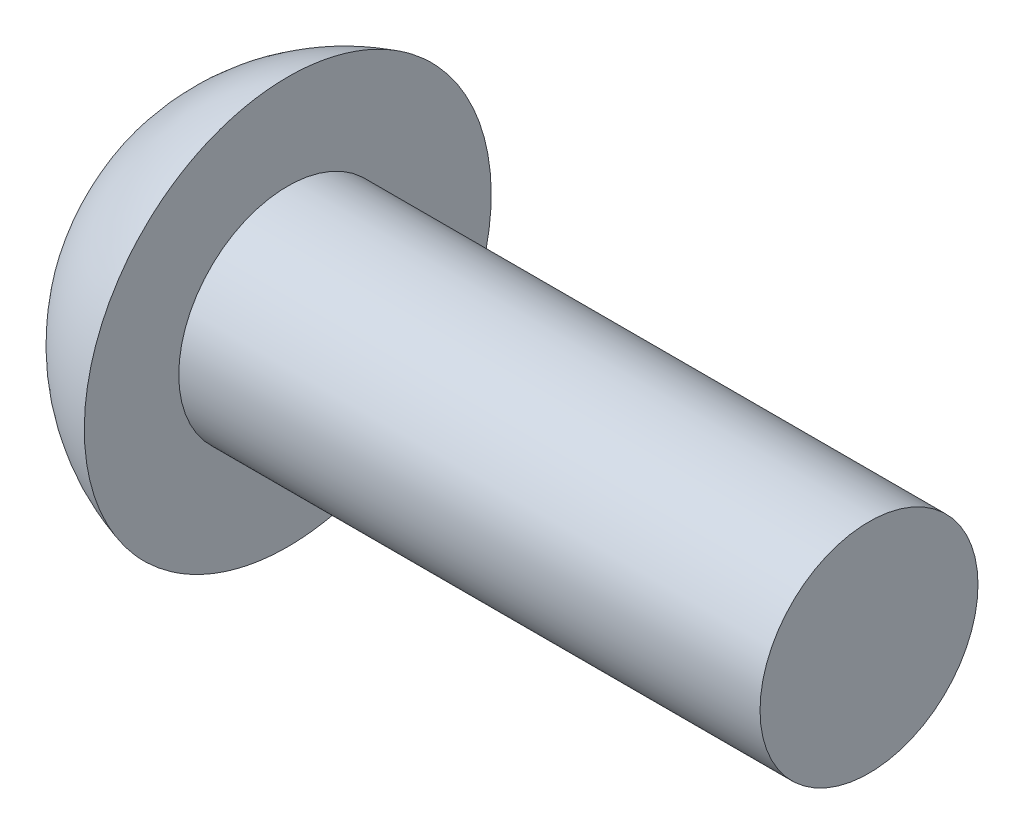
ISO-10303-21;
HEADER;
FILE_DESCRIPTION(('STEP AP214'),'2;1');
FILE_NAME('part.step','',(''),(''),'','','');
FILE_SCHEMA(('AUTOMOTIVE_DESIGN { 1 0 10303 214 1 1 1 1 }'));
ENDSEC;
DATA;
#1=APPLICATION_CONTEXT('core data for automotive mechanical design processes');
#2=APPLICATION_PROTOCOL_DEFINITION('international standard','automotive_design',2000,#1);
#3=PRODUCT_CONTEXT('',#1,'mechanical');
#4=PRODUCT('Part','Part','',(#3));
#5=PRODUCT_RELATED_PRODUCT_CATEGORY('part','',(#4));
#6=PRODUCT_DEFINITION_FORMATION('','',#4);
#7=PRODUCT_DEFINITION_CONTEXT('part definition',#1,'design');
#8=PRODUCT_DEFINITION('design','',#6,#7);
#9=PRODUCT_DEFINITION_SHAPE('','',#8);
#10=(LENGTH_UNIT() NAMED_UNIT(*) SI_UNIT(.MILLI.,.METRE.));
#11=(NAMED_UNIT(*) PLANE_ANGLE_UNIT() SI_UNIT($,.RADIAN.));
#12=(NAMED_UNIT(*) SI_UNIT($,.STERADIAN.) SOLID_ANGLE_UNIT());
#13=UNCERTAINTY_MEASURE_WITH_UNIT(LENGTH_MEASURE(1.E-05),#10,'distance_accuracy_value','');
#14=(GEOMETRIC_REPRESENTATION_CONTEXT(3) GLOBAL_UNCERTAINTY_ASSIGNED_CONTEXT((#13)) GLOBAL_UNIT_ASSIGNED_CONTEXT((#10,
#11,#12)) REPRESENTATION_CONTEXT('',''));
#15=CARTESIAN_POINT('',(0.,0.,0.));
#16=DIRECTION('',(0.,0.,1.));
#17=DIRECTION('',(1.,0.,0.));
#18=AXIS2_PLACEMENT_3D('',#15,#16,#17);
#19=CARTESIAN_POINT('',(1.3,0.,0.));
#20=DIRECTION('',(-1.,0.,0.));
#21=DIRECTION('',(0.,0.,1.));
#22=AXIS2_PLACEMENT_3D('',#19,#20,#21);
#23=PLANE('',#22);
#24=DIRECTION('',(0.,0.866025403784439,-0.5));
#25=VECTOR('',#24,1.);
#26=CARTESIAN_POINT('',(1.3,0.,-1.15470053837925));
#27=LINE('',#26,#25);
#28=CARTESIAN_POINT('',(1.3,0.,-1.15470053837925));
#29=VERTEX_POINT('',#28);
#30=CARTESIAN_POINT('',(1.3,-1.,-0.577350269189626));
#31=VERTEX_POINT('',#30);
#32=EDGE_CURVE('E95',#29,#31,#27,.F.);
#33=ORIENTED_EDGE('',*,*,#32,.T.);
#34=DIRECTION('',(0.,0.,-1.));
#35=VECTOR('',#34,1.);
#36=CARTESIAN_POINT('',(1.3,-1.,-0.577350269189626));
#37=LINE('',#36,#35);
#38=CARTESIAN_POINT('',(1.3,-1.,0.577350269189626));
#39=VERTEX_POINT('',#38);
#40=EDGE_CURVE('E142',#31,#39,#37,.F.);
#41=ORIENTED_EDGE('',*,*,#40,.T.);
#42=DIRECTION('',(0.,-0.866025403784439,-0.5));
#43=VECTOR('',#42,1.);
#44=CARTESIAN_POINT('',(1.3,-1.,0.577350269189626));
#45=LINE('',#44,#43);
#46=CARTESIAN_POINT('',(1.3,0.,1.15470053837925));
#47=VERTEX_POINT('',#46);
#48=EDGE_CURVE('E137',#39,#47,#45,.F.);
#49=ORIENTED_EDGE('',*,*,#48,.T.);
#50=DIRECTION('',(0.,-0.866025403784439,0.5));
#51=VECTOR('',#50,1.);
#52=CARTESIAN_POINT('',(1.3,0.,1.15470053837925));
#53=LINE('',#52,#51);
#54=CARTESIAN_POINT('',(1.3,1.,0.577350269189625));
#55=VERTEX_POINT('',#54);
#56=EDGE_CURVE('E78',#47,#55,#53,.F.);
#57=ORIENTED_EDGE('',*,*,#56,.T.);
#58=DIRECTION('',(0.,0.,1.));
#59=VECTOR('',#58,1.);
#60=CARTESIAN_POINT('',(1.3,1.,0.577350269189625));
#61=LINE('',#60,#59);
#62=CARTESIAN_POINT('',(1.3,1.,-0.577350269189626));
#63=VERTEX_POINT('',#62);
#64=EDGE_CURVE('E75',#55,#63,#61,.F.);
#65=ORIENTED_EDGE('',*,*,#64,.T.);
#66=DIRECTION('',(0.,0.866025403784439,0.5));
#67=VECTOR('',#66,1.);
#68=CARTESIAN_POINT('',(1.3,1.,-0.577350269189626));
#69=LINE('',#68,#67);
#70=EDGE_CURVE('E72',#63,#29,#69,.F.);
#71=ORIENTED_EDGE('',*,*,#70,.T.);
#72=EDGE_LOOP('',(#33,#41,#49,#57,#65,#71));
#73=FACE_BOUND('',#72,.T.);
#74=ADVANCED_FACE('F17',(#73),#23,.T.);
#75=CARTESIAN_POINT('',(1.3,1.,0.577350269189625));
#76=DIRECTION('',(0.,1.,0.));
#77=DIRECTION('',(0.,0.,1.));
#78=AXIS2_PLACEMENT_3D('',#75,#76,#77);
#79=PLANE('',#78);
#80=DIRECTION('',(1.,0.,0.));
#81=VECTOR('',#80,1.);
#82=CARTESIAN_POINT('',(1.3,1.,-0.577350269189626));
#83=LINE('',#82,#81);
#84=CARTESIAN_POINT('',(0.,1.,-0.577350269189626));
#85=VERTEX_POINT('',#84);
#86=EDGE_CURVE('E81',#85,#63,#83,.T.);
#87=ORIENTED_EDGE('',*,*,#86,.T.);
#88=ORIENTED_EDGE('',*,*,#64,.F.);
#89=DIRECTION('',(1.,0.,0.));
#90=VECTOR('',#89,1.);
#91=CARTESIAN_POINT('',(1.3,1.,0.577350269189625));
#92=LINE('',#91,#90);
#93=CARTESIAN_POINT('',(0.,1.,0.577350269189625));
#94=VERTEX_POINT('',#93);
#95=EDGE_CURVE('E132',#55,#94,#92,.F.);
#96=ORIENTED_EDGE('',*,*,#95,.T.);
#97=DIRECTION('',(0.,0.,-1.));
#98=VECTOR('',#97,1.);
#99=CARTESIAN_POINT('',(0.,1.,0.));
#100=LINE('',#99,#98);
#101=EDGE_CURVE('E86',#94,#85,#100,.T.);
#102=ORIENTED_EDGE('',*,*,#101,.T.);
#103=EDGE_LOOP('',(#87,#88,#96,#102));
#104=FACE_BOUND('',#103,.T.);
#105=ADVANCED_FACE('F84',(#104),#79,.F.);
#106=CARTESIAN_POINT('',(1.3,1.,-0.577350269189626));
#107=DIRECTION('',(0.,0.5,-0.866025403784439));
#108=DIRECTION('',(0.,0.866025403784439,0.5));
#109=AXIS2_PLACEMENT_3D('',#106,#107,#108);
#110=PLANE('',#109);
#111=DIRECTION('',(1.,0.,0.));
#112=VECTOR('',#111,1.);
#113=CARTESIAN_POINT('',(1.3,0.,-1.15470053837925));
#114=LINE('',#113,#112);
#115=CARTESIAN_POINT('',(0.,0.,-1.15470053837925));
#116=VERTEX_POINT('',#115);
#117=EDGE_CURVE('E92',#116,#29,#114,.T.);
#118=ORIENTED_EDGE('',*,*,#117,.T.);
#119=ORIENTED_EDGE('',*,*,#70,.F.);
#120=ORIENTED_EDGE('',*,*,#86,.F.);
#121=DIRECTION('',(0.,-0.866025403784439,-0.5));
#122=VECTOR('',#121,1.);
#123=CARTESIAN_POINT('',(0.,1.,-0.577350269189626));
#124=LINE('',#123,#122);
#125=EDGE_CURVE('E129',#85,#116,#124,.T.);
#126=ORIENTED_EDGE('',*,*,#125,.T.);
#127=EDGE_LOOP('',(#118,#119,#120,#126));
#128=FACE_BOUND('',#127,.T.);
#129=ADVANCED_FACE('F90',(#128),#110,.F.);
#130=CARTESIAN_POINT('',(1.3,0.,-1.15470053837925));
#131=DIRECTION('',(0.,-0.5,-0.866025403784439));
#132=DIRECTION('',(0.,0.866025403784439,-0.5));
#133=AXIS2_PLACEMENT_3D('',#130,#131,#132);
#134=PLANE('',#133);
#135=DIRECTION('',(1.,0.,0.));
#136=VECTOR('',#135,1.);
#137=CARTESIAN_POINT('',(1.3,-1.,-0.577350269189626));
#138=LINE('',#137,#136);
#139=CARTESIAN_POINT('',(0.,-1.,-0.577350269189626));
#140=VERTEX_POINT('',#139);
#141=EDGE_CURVE('E144',#140,#31,#138,.T.);
#142=ORIENTED_EDGE('',*,*,#141,.T.);
#143=ORIENTED_EDGE('',*,*,#32,.F.);
#144=ORIENTED_EDGE('',*,*,#117,.F.);
#145=DIRECTION('',(0.,-0.866025403784439,0.5));
#146=VECTOR('',#145,1.);
#147=CARTESIAN_POINT('',(0.,0.,-1.15470053837925));
#148=LINE('',#147,#146);
#149=EDGE_CURVE('E127',#116,#140,#148,.T.);
#150=ORIENTED_EDGE('',*,*,#149,.T.);
#151=EDGE_LOOP('',(#142,#143,#144,#150));
#152=FACE_BOUND('',#151,.T.);
#153=ADVANCED_FACE('F149',(#152),#134,.F.);
#154=CARTESIAN_POINT('',(1.3,-1.,-0.577350269189626));
#155=DIRECTION('',(0.,-1.,0.));
#156=DIRECTION('',(0.,0.,-1.));
#157=AXIS2_PLACEMENT_3D('',#154,#155,#156);
#158=PLANE('',#157);
#159=DIRECTION('',(1.,0.,0.));
#160=VECTOR('',#159,1.);
#161=CARTESIAN_POINT('',(1.3,-1.,0.577350269189626));
#162=LINE('',#161,#160);
#163=CARTESIAN_POINT('',(0.,-1.,0.577350269189626));
#164=VERTEX_POINT('',#163);
#165=EDGE_CURVE('E139',#164,#39,#162,.T.);
#166=ORIENTED_EDGE('',*,*,#165,.T.);
#167=ORIENTED_EDGE('',*,*,#40,.F.);
#168=ORIENTED_EDGE('',*,*,#141,.F.);
#169=DIRECTION('',(0.,0.,-1.));
#170=VECTOR('',#169,1.);
#171=CARTESIAN_POINT('',(0.,-1.,0.));
#172=LINE('',#171,#170);
#173=EDGE_CURVE('E125',#140,#164,#172,.F.);
#174=ORIENTED_EDGE('',*,*,#173,.T.);
#175=EDGE_LOOP('',(#166,#167,#168,#174));
#176=FACE_BOUND('',#175,.T.);
#177=ADVANCED_FACE('F153',(#176),#158,.F.);
#178=CARTESIAN_POINT('',(1.3,-1.,0.577350269189626));
#179=DIRECTION('',(0.,-0.5,0.866025403784439));
#180=DIRECTION('',(0.,-0.866025403784439,-0.5));
#181=AXIS2_PLACEMENT_3D('',#178,#179,#180);
#182=PLANE('',#181);
#183=DIRECTION('',(1.,0.,0.));
#184=VECTOR('',#183,1.);
#185=CARTESIAN_POINT('',(1.3,0.,1.15470053837925));
#186=LINE('',#185,#184);
#187=CARTESIAN_POINT('',(0.,0.,1.15470053837925));
#188=VERTEX_POINT('',#187);
#189=EDGE_CURVE('E135',#188,#47,#186,.T.);
#190=ORIENTED_EDGE('',*,*,#189,.T.);
#191=ORIENTED_EDGE('',*,*,#48,.F.);
#192=ORIENTED_EDGE('',*,*,#165,.F.);
#193=DIRECTION('',(0.,0.866025403784439,0.5));
#194=VECTOR('',#193,1.);
#195=CARTESIAN_POINT('',(0.,-1.,0.577350269189626));
#196=LINE('',#195,#194);
#197=EDGE_CURVE('E39',#164,#188,#196,.T.);
#198=ORIENTED_EDGE('',*,*,#197,.T.);
#199=EDGE_LOOP('',(#190,#191,#192,#198));
#200=FACE_BOUND('',#199,.T.);
#201=ADVANCED_FACE('F155',(#200),#182,.F.);
#202=CARTESIAN_POINT('',(1.3,0.,1.15470053837925));
#203=DIRECTION('',(0.,0.5,0.866025403784439));
#204=DIRECTION('',(0.,-0.866025403784439,0.5));
#205=AXIS2_PLACEMENT_3D('',#202,#203,#204);
#206=PLANE('',#205);
#207=ORIENTED_EDGE('',*,*,#95,.F.);
#208=ORIENTED_EDGE('',*,*,#56,.F.);
#209=ORIENTED_EDGE('',*,*,#189,.F.);
#210=DIRECTION('',(0.,0.866025403784438,-0.5));
#211=VECTOR('',#210,1.);
#212=CARTESIAN_POINT('',(0.,0.,1.15470053837925));
#213=LINE('',#212,#211);
#214=EDGE_CURVE('E121',#188,#94,#213,.T.);
#215=ORIENTED_EDGE('',*,*,#214,.T.);
#216=EDGE_LOOP('',(#207,#208,#209,#215));
#217=FACE_BOUND('',#216,.T.);
#218=ADVANCED_FACE('F158',(#217),#206,.F.);
#219=CARTESIAN_POINT('',(0.,0.,0.));
#220=DIRECTION('',(1.,0.,0.));
#221=DIRECTION('',(0.,0.,-1.));
#222=AXIS2_PLACEMENT_3D('',#219,#220,#221);
#223=PLANE('',#222);
#224=CARTESIAN_POINT('',(0.,-1.8,0.));
#225=CARTESIAN_POINT('',(0.,-1.79999969693813,-0.0505383553463635));
#226=CARTESIAN_POINT('',(0.,-1.79786965821117,-0.101085998847833));
#227=CARTESIAN_POINT('',(0.,-1.78936335708246,-0.201831968349741));
#228=CARTESIAN_POINT('',(1.51082278575251E-13,-1.78298584106246,-0.252030186798317));
#229=CARTESIAN_POINT('',(-1.51322682909344E-13,-1.76601326021542,-0.35179543440894));
#230=CARTESIAN_POINT('',(-5.65737505546988E-13,-1.7554115005106,-0.401361332113267));
#231=CARTESIAN_POINT('',(5.66197562207899E-13,-1.73006357821317,-0.4994513470748));
#232=CARTESIAN_POINT('',(2.11414221677564E-12,-1.7153140524109,-0.547974584380644));
#233=CARTESIAN_POINT('',(3.79906899358734E-12,-1.66504737561974,-0.691252996354969));
#234=CARTESIAN_POINT('',(9.98592384995183E-13,-1.62347083872427,-0.783957995374269));
#235=CARTESIAN_POINT('',(-9.98630349733625E-13,-1.5253242715079,-0.961060444041288));
#236=CARTESIAN_POINT('',(-1.95239464283448E-13,-1.46875367122068,-1.0454575777165));
#237=CARTESIAN_POINT('',(0.,-1.37393237862705,-1.1639935576829));
#238=CARTESIAN_POINT('',(0.,-1.34063934533778,-1.20218459533929));
#239=CARTESIAN_POINT('',(0.,-1.27099181665424,-1.27559317409802));
#240=CARTESIAN_POINT('',(0.,-1.2346403039193,-1.31081354659702));
#241=CARTESIAN_POINT('',(1.48805571757469E-13,-1.12128865477494,-1.41171053074979));
#242=CARTESIAN_POINT('',(7.20683997385531E-13,-1.03997085608677,-1.47264864886824));
#243=CARTESIAN_POINT('',(7.19136516855849E-13,-0.868302977752408,-1.57997169667932));
#244=CARTESIAN_POINT('',(1.45753802767248E-13,-0.777953238856439,-1.62635717512993));
#245=CARTESIAN_POINT('',(-1.45752246016539E-13,-0.590738654674472,-1.70330985037171));
#246=CARTESIAN_POINT('',(1.36115284596168E-13,-0.493873878984592,-1.73387721610768));
#247=CARTESIAN_POINT('',(2.28176891181211E-13,-0.296389602022537,-1.77831350061169));
#248=CARTESIAN_POINT('',(0.,-0.195770080701388,-1.79218233020245));
#249=CARTESIAN_POINT('',(0.,0.00636923610669066,-1.8028319006549));
#250=CARTESIAN_POINT('',(0.,0.107889031593619,-1.79961264151658));
#251=CARTESIAN_POINT('',(0.,0.308949283786902,-1.77617340058004));
#252=CARTESIAN_POINT('',(0.,0.408489751060766,-1.75595350957209));
#253=CARTESIAN_POINT('',(0.,0.602753886185802,-1.69909877747923));
#254=CARTESIAN_POINT('',(0.,0.697477502578339,-1.66246376107181));
#255=CARTESIAN_POINT('',(0.,0.879472223548245,-1.5737731833174));
#256=CARTESIAN_POINT('',(0.,0.966743046923559,-1.52171704044529));
#257=CARTESIAN_POINT('',(0.,1.09006914068348,-1.43328925989624));
#258=CARTESIAN_POINT('',(0.,1.12992026465015,-1.40208357074052));
#259=CARTESIAN_POINT('',(0.,1.20689578170788,-1.33639972599313));
#260=CARTESIAN_POINT('',(0.,1.24401750616591,-1.30191844127035));
#261=CARTESIAN_POINT('',(1.41312368385701E-13,1.35076927785449,-1.19400219913293));
#262=CARTESIAN_POINT('',(0.,1.41589490317864,-1.11601654714749));
#263=CARTESIAN_POINT('',(0.,1.53210752784414,-0.950207464620378));
#264=CARTESIAN_POINT('',(0.,1.5831950607951,-0.862384408192342));
#265=CARTESIAN_POINT('',(0.,1.64823872656556,-0.725181042064782));
#266=CARTESIAN_POINT('',(0.,1.66800527485629,-0.678476260310491));
#267=CARTESIAN_POINT('',(0.,1.70351987444945,-0.58359274532641));
#268=CARTESIAN_POINT('',(0.,1.71927117788053,-0.535415240572518));
#269=CARTESIAN_POINT('',(0.,1.74663282949914,-0.437985711413426));
#270=CARTESIAN_POINT('',(0.,1.75824971661208,-0.388735515679738));
#271=CARTESIAN_POINT('',(0.,1.77729500833267,-0.28944108283944));
#272=CARTESIAN_POINT('',(0.,1.78472464831743,-0.239397084415696));
#273=CARTESIAN_POINT('',(0.,1.79335428483933,-0.157729601792057));
#274=CARTESIAN_POINT('',(0.,1.79584563928913,-0.126236872827487));
#275=CARTESIAN_POINT('',(0.,1.79916859156829,-0.0631639717658371));
#276=CARTESIAN_POINT('',(0.,1.80000018939764,-0.0315837996687575));
#277=CARTESIAN_POINT('',(0.,1.79999969693813,0.0505383553463631));
#278=CARTESIAN_POINT('',(0.,1.79786965821117,0.101085998847832));
#279=CARTESIAN_POINT('',(0.,1.78936335708246,0.201831968349741));
#280=CARTESIAN_POINT('',(1.51223719563358E-13,1.78298584106246,0.252030186798317));
#281=CARTESIAN_POINT('',(-1.51464348960423E-13,1.76601326021542,0.35179543440894));
#282=CARTESIAN_POINT('',(-5.65776150115376E-13,1.7554115005106,0.401361332113266));
#283=CARTESIAN_POINT('',(5.66236238201977E-13,1.73006357821317,0.499451347074799));
#284=CARTESIAN_POINT('',(2.11415508710456E-12,1.7153140524109,0.547974584380644));
#285=CARTESIAN_POINT('',(3.79904331428084E-12,1.66504737561974,0.691252996354968));
#286=CARTESIAN_POINT('',(9.98592521376187E-13,1.62347083872427,0.783957995374268));
#287=CARTESIAN_POINT('',(-9.98630486119814E-13,1.5253242715079,0.961060444041287));
#288=CARTESIAN_POINT('',(-1.95265691097682E-13,1.46875367122068,1.04545757771649));
#289=CARTESIAN_POINT('',(0.,1.37393237862705,1.1639935576829));
#290=CARTESIAN_POINT('',(0.,1.34063934533778,1.20218459533929));
#291=CARTESIAN_POINT('',(0.,1.27099181665424,1.27559317409802));
#292=CARTESIAN_POINT('',(0.,1.23464030391931,1.31081354659702));
#293=CARTESIAN_POINT('',(1.49093811615131E-13,1.12128865477494,1.41171053074979));
#294=CARTESIAN_POINT('',(7.2225582028326E-13,1.03997085608677,1.47264864886824));
#295=CARTESIAN_POINT('',(7.21034134766602E-13,0.868302977752409,1.57997169667932));
#296=CARTESIAN_POINT('',(1.46693717178003E-13,0.77795323885644,1.62635717512993));
#297=CARTESIAN_POINT('',(-1.46692150388362E-13,0.590738654674473,1.70330985037171));
#298=CARTESIAN_POINT('',(1.34253264561769E-13,0.493873878984593,1.73387721610768));
#299=CARTESIAN_POINT('',(2.2656946494347E-13,0.296389602022538,1.77831350061169));
#300=CARTESIAN_POINT('',(0.,0.195770080701389,1.79218233020245));
#301=CARTESIAN_POINT('',(0.,-0.00636923610668964,1.8028319006549));
#302=CARTESIAN_POINT('',(0.,-0.107889031593618,1.79961264151659));
#303=CARTESIAN_POINT('',(0.,-0.308949283786901,1.77617340058004));
#304=CARTESIAN_POINT('',(0.,-0.408489751060765,1.75595350957209));
#305=CARTESIAN_POINT('',(0.,-0.602753886185801,1.69909877747923));
#306=CARTESIAN_POINT('',(0.,-0.697477502578338,1.66246376107181));
#307=CARTESIAN_POINT('',(0.,-0.879472223548244,1.5737731833174));
#308=CARTESIAN_POINT('',(0.,-0.966743046923559,1.52171704044529));
#309=CARTESIAN_POINT('',(0.,-1.09006914068348,1.43328925989624));
#310=CARTESIAN_POINT('',(0.,-1.12992026465015,1.40208357074052));
#311=CARTESIAN_POINT('',(0.,-1.20689578170787,1.33639972599313));
#312=CARTESIAN_POINT('',(0.,-1.24401750616591,1.30191844127035));
#313=CARTESIAN_POINT('',(1.4131380875108E-13,-1.35076927785449,1.19400219913293));
#314=CARTESIAN_POINT('',(0.,-1.41589490317864,1.11601654714749));
#315=CARTESIAN_POINT('',(0.,-1.53210752784414,0.950207464620379));
#316=CARTESIAN_POINT('',(0.,-1.58319506079509,0.862384408192342));
#317=CARTESIAN_POINT('',(0.,-1.64823872656556,0.725181042064783));
#318=CARTESIAN_POINT('',(0.,-1.66800527485629,0.678476260310492));
#319=CARTESIAN_POINT('',(0.,-1.70351987444946,0.583592745326411));
#320=CARTESIAN_POINT('',(0.,-1.71927117788053,0.535415240572518));
#321=CARTESIAN_POINT('',(0.,-1.74663282949914,0.437985711413426));
#322=CARTESIAN_POINT('',(0.,-1.75824971661208,0.388735515679739));
#323=CARTESIAN_POINT('',(0.,-1.77729500833267,0.289441082839441));
#324=CARTESIAN_POINT('',(0.,-1.78472464831743,0.239397084415697));
#325=CARTESIAN_POINT('',(0.,-1.79335428483933,0.157729601792057));
#326=CARTESIAN_POINT('',(0.,-1.79584563928913,0.126236872827487));
#327=CARTESIAN_POINT('',(0.,-1.79916859156829,0.0631639717658369));
#328=CARTESIAN_POINT('',(0.,-1.80000018939764,0.0315837996687572));
#329=CARTESIAN_POINT('',(0.,-1.8,0.));
#330=B_SPLINE_CURVE_WITH_KNOTS('',3,(#224,#225,#226,#227,#228,#229,#230,#231,#232,#233,#234,
#235,#236,#237,#238,#239,#240,#241,#242,#243,#244,#245,#246,#247,#248,#249,#250,#251,#252,#253,
#254,#255,#256,#257,#258,#259,#260,#261,#262,#263,#264,#265,#266,#267,#268,#269,#270,#271,#272,
#273,#274,#275,#276,#277,#278,#279,#280,#281,#282,#283,#284,#285,#286,#287,#288,#289,#290,#291,
#292,#293,#294,#295,#296,#297,#298,#299,#300,#301,#302,#303,#304,#305,#306,#307,#308,#309,#310,
#311,#312,#313,#314,#315,#316,#317,#318,#319,#320,#321,#322,#323,#324,#325,#326,#327,#328,#329),
.UNSPECIFIED.,.T.,.F.,(4,2,2,2,2,2,2,2,2,2,2,2,2,2,2,2,2,2,2,2,2,2,2,2,2,2,2,2,2,2,2,2,2,2,2,2,
2,2,2,2,2,2,2,2,2,2,2,2,2,2,2,2,4),(0.,0.151585989710196,0.303216738983041,0.455088765324584,
0.607084293708399,0.910350805750164,1.21362884745506,1.36546657207417,1.51715790225758,
1.82044323652332,2.12371713298388,2.42698779027096,2.73026006714468,3.03353234401834,
3.33680300130515,3.6400768977656,3.94336223203168,4.09505356221516,4.24689128683427,
4.55016932853894,4.8534358405808,5.00543136896507,5.15730339530697,5.30893414458,
5.46052013429044,5.55525336212866,5.64998658996691,5.8015725796771,5.95320332894995,
6.10507535529149,6.25707088367531,6.56033739571707,6.86361543742197,7.01545316204107,
7.16714449222448,7.47042982649022,7.77370372295079,8.07697438023787,8.38024665711159,
8.68351893398524,8.98678959127205,9.29006348773251,9.59334882199858,9.74504015218206,
9.89687787680118,10.2001559185058,10.5034224305477,10.655417958932,10.8072899852739,
10.9589207345469,11.1105067242574,11.2052399520956,11.2999731799338),.UNSPECIFIED.);
#331=CARTESIAN_POINT('',(0.,-1.8,0.));
#332=VERTEX_POINT('',#331);
#333=EDGE_CURVE('E20',#332,#332,#330,.T.);
#334=ORIENTED_EDGE('',*,*,#333,.F.);
#335=EDGE_LOOP('',(#334));
#336=FACE_BOUND('',#335,.T.);
#337=ORIENTED_EDGE('',*,*,#197,.F.);
#338=ORIENTED_EDGE('',*,*,#173,.F.);
#339=ORIENTED_EDGE('',*,*,#149,.F.);
#340=ORIENTED_EDGE('',*,*,#125,.F.);
#341=ORIENTED_EDGE('',*,*,#101,.F.);
#342=ORIENTED_EDGE('',*,*,#214,.F.);
#343=EDGE_LOOP('',(#337,#338,#339,#340,#341,#342));
#344=FACE_BOUND('',#343,.T.);
#345=ADVANCED_FACE('F114',(#336,#344),#223,.F.);
#346=CARTESIAN_POINT('',(2.28333333333333,0.,0.));
#347=DIRECTION('',(0.,1.,0.));
#348=DIRECTION('',(1.,0.,0.));
#349=AXIS2_PLACEMENT_3D('',#346,#347,#348);
#350=SPHERICAL_SURFACE('',#349,2.90750943439761);
#351=ORIENTED_EDGE('',*,*,#333,.T.);
#352=EDGE_LOOP('',(#351));
#353=FACE_BOUND('',#352,.T.);
#354=CARTESIAN_POINT('',(1.5,2.8,0.));
#355=CARTESIAN_POINT('',(1.5,2.80000058114663,-0.097602902906246));
#356=CARTESIAN_POINT('',(1.5,2.79489033321137,-0.195197225793099));
#357=CARTESIAN_POINT('',(1.5,2.77451565330272,-0.389368402876138));
#358=CARTESIAN_POINT('',(1.5,2.75924432689463,-0.485944520978123));
#359=CARTESIAN_POINT('',(1.5,2.70627858731671,-0.735356657485282));
#360=CARTESIAN_POINT('',(1.5,2.66058825775473,-0.886570466076757));
#361=CARTESIAN_POINT('',(1.5,2.54443496530946,-1.17927883826553));
#362=CARTESIAN_POINT('',(1.5,2.47394598727788,-1.32076300787352));
#363=CARTESIAN_POINT('',(1.5,2.31023409393156,-1.5898419060271));
#364=CARTESIAN_POINT('',(1.5,2.21702056371508,-1.71744233708582));
#365=CARTESIAN_POINT('',(1.5,2.01051665662982,-1.95514926157889));
#366=CARTESIAN_POINT('',(1.5,1.89723083380139,-2.06525971244938));
#367=CARTESIAN_POINT('',(1.5,1.65377108245464,-2.26491180732828));
#368=CARTESIAN_POINT('',(1.5,1.52359556754626,-2.35445151700685));
#369=CARTESIAN_POINT('',(1.5,1.2500547452375,-2.51040859878638));
#370=CARTESIAN_POINT('',(1.5,1.1066889282367,-2.57682507705875));
#371=CARTESIAN_POINT('',(1.5,0.810844291441425,-2.68464490303648));
#372=CARTESIAN_POINT('',(1.5,0.658365634865098,-2.72604869859128));
#373=CARTESIAN_POINT('',(1.5,0.348621867363057,-2.78266949830994));
#374=CARTESIAN_POINT('',(1.5,0.191356770024622,-2.79788657680303));
#375=CARTESIAN_POINT('',(1.5,-0.123496096015709,-2.80170224104092));
#376=CARTESIAN_POINT('',(1.5,-0.281083864890645,-2.79030081250716));
#377=CARTESIAN_POINT('',(1.5,-0.592108819054531,-2.74120301008156));
#378=CARTESIAN_POINT('',(1.5,-0.745545997014651,-2.70350658976297));
#379=CARTESIAN_POINT('',(1.5,-1.04391584692778,-2.60288826070579));
#380=CARTESIAN_POINT('',(1.5,-1.18884840460742,-2.53996601310625));
#381=CARTESIAN_POINT('',(1.5,-1.46608850320062,-2.39068404738938));
#382=CARTESIAN_POINT('',(1.5,-1.59839640547873,-2.30432500039254));
#383=CARTESIAN_POINT('',(1.5,-1.84662736593538,-2.11062813801582));
#384=CARTESIAN_POINT('',(1.5,-1.96255156458538,-2.00329178410926));
#385=CARTESIAN_POINT('',(1.5,-2.1747542244558,-1.77065850816234));
#386=CARTESIAN_POINT('',(1.5,-2.27102938322741,-1.64535857296605));
#387=CARTESIAN_POINT('',(1.5,-2.44120016914855,-1.38034674222735));
#388=CARTESIAN_POINT('',(1.5,-2.51508899178783,-1.24063048198967));
#389=CARTESIAN_POINT('',(1.5,-2.63830716797482,-0.950832062564711));
#390=CARTESIAN_POINT('',(1.5,-2.68765551021545,-0.800758020642758));
#391=CARTESIAN_POINT('',(1.5,-2.74927114196675,-0.54167924182637));
#392=CARTESIAN_POINT('',(1.5,-2.7682728701565,-0.434222541732076));
#393=CARTESIAN_POINT('',(1.5,-2.79363458299388,-0.217839951954246));
#394=CARTESIAN_POINT('',(1.5,-2.79999935150113,-0.108914633959985));
#395=CARTESIAN_POINT('',(1.5,-2.80000058114663,0.0976029029062455));
#396=CARTESIAN_POINT('',(1.5,-2.79489033321137,0.195197225793099));
#397=CARTESIAN_POINT('',(1.5,-2.77451565330272,0.389368402876137));
#398=CARTESIAN_POINT('',(1.5,-2.75924432689463,0.485944520978123));
#399=CARTESIAN_POINT('',(1.5,-2.70627858731672,0.735356657485282));
#400=CARTESIAN_POINT('',(1.5,-2.66058825775473,0.886570466076757));
#401=CARTESIAN_POINT('',(1.5,-2.54443496530946,1.17927883826553));
#402=CARTESIAN_POINT('',(1.5,-2.47394598727788,1.32076300787352));
#403=CARTESIAN_POINT('',(1.5,-2.31023409393156,1.5898419060271));
#404=CARTESIAN_POINT('',(1.5,-2.21702056371508,1.71744233708582));
#405=CARTESIAN_POINT('',(1.5,-2.01051665662982,1.95514926157889));
#406=CARTESIAN_POINT('',(1.5,-1.89723083380139,2.06525971244938));
#407=CARTESIAN_POINT('',(1.5,-1.65377108245464,2.26491180732828));
#408=CARTESIAN_POINT('',(1.5,-1.52359556754626,2.35445151700685));
#409=CARTESIAN_POINT('',(1.5,-1.2500547452375,2.51040859878638));
#410=CARTESIAN_POINT('',(1.5,-1.1066889282367,2.57682507705875));
#411=CARTESIAN_POINT('',(1.5,-0.810844291441425,2.68464490303648));
#412=CARTESIAN_POINT('',(1.5,-0.658365634865099,2.72604869859128));
#413=CARTESIAN_POINT('',(1.5,-0.348621867363058,2.78266949830994));
#414=CARTESIAN_POINT('',(1.5,-0.191356770024623,2.79788657680303));
#415=CARTESIAN_POINT('',(1.5,0.123496096015708,2.80170224104092));
#416=CARTESIAN_POINT('',(1.5,0.281083864890645,2.79030081250716));
#417=CARTESIAN_POINT('',(1.5,0.592108819054531,2.74120301008156));
#418=CARTESIAN_POINT('',(1.5,0.74554599701465,2.70350658976297));
#419=CARTESIAN_POINT('',(1.5,1.04391584692778,2.6028882607058));
#420=CARTESIAN_POINT('',(1.5,1.18884840460742,2.53996601310625));
#421=CARTESIAN_POINT('',(1.5,1.46608850320062,2.39068404738938));
#422=CARTESIAN_POINT('',(1.5,1.59839640547873,2.30432500039254));
#423=CARTESIAN_POINT('',(1.5,1.84662736593538,2.11062813801582));
#424=CARTESIAN_POINT('',(1.5,1.96255156458538,2.00329178410926));
#425=CARTESIAN_POINT('',(1.5,2.1747542244558,1.77065850816234));
#426=CARTESIAN_POINT('',(1.5,2.27102938322741,1.64535857296605));
#427=CARTESIAN_POINT('',(1.5,2.44120016914855,1.38034674222735));
#428=CARTESIAN_POINT('',(1.5,2.51508899178783,1.24063048198967));
#429=CARTESIAN_POINT('',(1.5,2.63830716797482,0.950832062564712));
#430=CARTESIAN_POINT('',(1.5,2.68765551021545,0.800758020642758));
#431=CARTESIAN_POINT('',(1.5,2.74927114196675,0.54167924182637));
#432=CARTESIAN_POINT('',(1.5,2.7682728701565,0.434222541732076));
#433=CARTESIAN_POINT('',(1.5,2.79363458299388,0.217839951954245));
#434=CARTESIAN_POINT('',(1.5,2.79999935150113,0.108914633959985));
#435=CARTESIAN_POINT('',(1.5,2.8,0.));
#436=B_SPLINE_CURVE_WITH_KNOTS('',3,(#354,#355,#356,#357,#358,#359,#360,#361,#362,#363,#364,
#365,#366,#367,#368,#369,#370,#371,#372,#373,#374,#375,#376,#377,#378,#379,#380,#381,#382,#383,
#384,#385,#386,#387,#388,#389,#390,#391,#392,#393,#394,#395,#396,#397,#398,#399,#400,#401,#402,
#403,#404,#405,#406,#407,#408,#409,#410,#411,#412,#413,#414,#415,#416,#417,#418,#419,#420,#421,
#422,#423,#424,#425,#426,#427,#428,#429,#430,#431,#432,#433,#434,#435),.UNSPECIFIED.,.T.,.F.,(4,
2,2,2,2,2,2,2,2,2,2,2,2,2,2,2,2,2,2,2,2,2,2,2,2,2,2,2,2,2,2,2,2,2,2,2,2,2,2,2,4),(0.,
0.292649740000539,0.58549824973262,1.05700706396217,1.52901199916255,2.00082232852149,
2.47252574939804,2.94427350785476,3.41603949969872,3.88779704437215,4.35955324999121,
4.83130970866732,5.30306700028442,5.77483062927493,6.24658075058338,6.71829801712136,
7.19009450084165,7.66203424742664,8.13360825067272,8.46029845584223,8.78686496525497,
9.07951470525551,9.37236321498759,9.84387202921714,10.3158769644175,10.7876872937765,
11.259390714653,11.7311384731097,12.2029044649537,12.6746620096271,13.1464182152462,
13.6181746739223,14.0899319655394,14.5616955945299,15.0334457158384,15.5051629823763,
15.9769594660966,16.4488992126816,16.9204732159277,17.2471634210972,17.5737299305099),.UNSPECIFIED.);
#437=CARTESIAN_POINT('',(1.5,2.8,0.));
#438=VERTEX_POINT('',#437);
#439=EDGE_CURVE('E100',#438,#438,#436,.T.);
#440=ORIENTED_EDGE('',*,*,#439,.T.);
#441=EDGE_LOOP('',(#440));
#442=FACE_BOUND('',#441,.T.);
#443=ADVANCED_FACE('F109',(#353,#442),#350,.T.);
#444=CARTESIAN_POINT('',(9.5,0.,0.));
#445=DIRECTION('',(-1.,0.,0.));
#446=DIRECTION('',(0.,0.,1.));
#447=AXIS2_PLACEMENT_3D('',#444,#445,#446);
#448=PLANE('',#447);
#449=CARTESIAN_POINT('',(9.5,0.,0.));
#450=DIRECTION('',(-1.,0.,0.));
#451=DIRECTION('',(0.,0.,1.));
#452=AXIS2_PLACEMENT_3D('',#449,#450,#451);
#453=CIRCLE('',#452,1.5);
#454=CARTESIAN_POINT('',(9.5,0.,1.5));
#455=VERTEX_POINT('',#454);
#456=EDGE_CURVE('E30',#455,#455,#453,.T.);
#457=ORIENTED_EDGE('',*,*,#456,.F.);
#458=EDGE_LOOP('',(#457));
#459=FACE_BOUND('',#458,.T.);
#460=ADVANCED_FACE('F113',(#459),#448,.F.);
#461=CARTESIAN_POINT('',(1.5,1.5,0.));
#462=DIRECTION('',(-1.,0.,0.));
#463=DIRECTION('',(0.,0.,1.));
#464=AXIS2_PLACEMENT_3D('',#461,#462,#463);
#465=PLANE('',#464);
#466=CARTESIAN_POINT('',(1.5,0.,0.));
#467=DIRECTION('',(-1.,0.,0.));
#468=DIRECTION('',(0.,0.,1.));
#469=AXIS2_PLACEMENT_3D('',#466,#467,#468);
#470=CIRCLE('',#469,1.5);
#471=CARTESIAN_POINT('',(1.5,0.,1.5));
#472=VERTEX_POINT('',#471);
#473=EDGE_CURVE('E11',#472,#472,#470,.F.);
#474=ORIENTED_EDGE('',*,*,#473,.F.);
#475=EDGE_LOOP('',(#474));
#476=FACE_BOUND('',#475,.T.);
#477=ORIENTED_EDGE('',*,*,#439,.F.);
#478=EDGE_LOOP('',(#477));
#479=FACE_BOUND('',#478,.T.);
#480=ADVANCED_FACE('F105',(#476,#479),#465,.F.);
#481=CARTESIAN_POINT('',(-16.5029441624365,0.,0.));
#482=DIRECTION('',(-1.,0.,0.));
#483=DIRECTION('',(0.,0.,1.));
#484=AXIS2_PLACEMENT_3D('',#481,#482,#483);
#485=CYLINDRICAL_SURFACE('',#484,1.5);
#486=ORIENTED_EDGE('',*,*,#473,.T.);
#487=EDGE_LOOP('',(#486));
#488=FACE_BOUND('',#487,.T.);
#489=ORIENTED_EDGE('',*,*,#456,.T.);
#490=EDGE_LOOP('',(#489));
#491=FACE_BOUND('',#490,.T.);
#492=ADVANCED_FACE('F167',(#488,#491),#485,.T.);
#493=CLOSED_SHELL('',(#74,#105,#129,#153,#177,#201,#218,#345,#443,#460,#480,#492));
#494=MANIFOLD_SOLID_BREP('B1',#493);
#495=ADVANCED_BREP_SHAPE_REPRESENTATION('',(#18,#494),#14);
#496=SHAPE_DEFINITION_REPRESENTATION(#9,#495);
ENDSEC;
END-ISO-10303-21;
